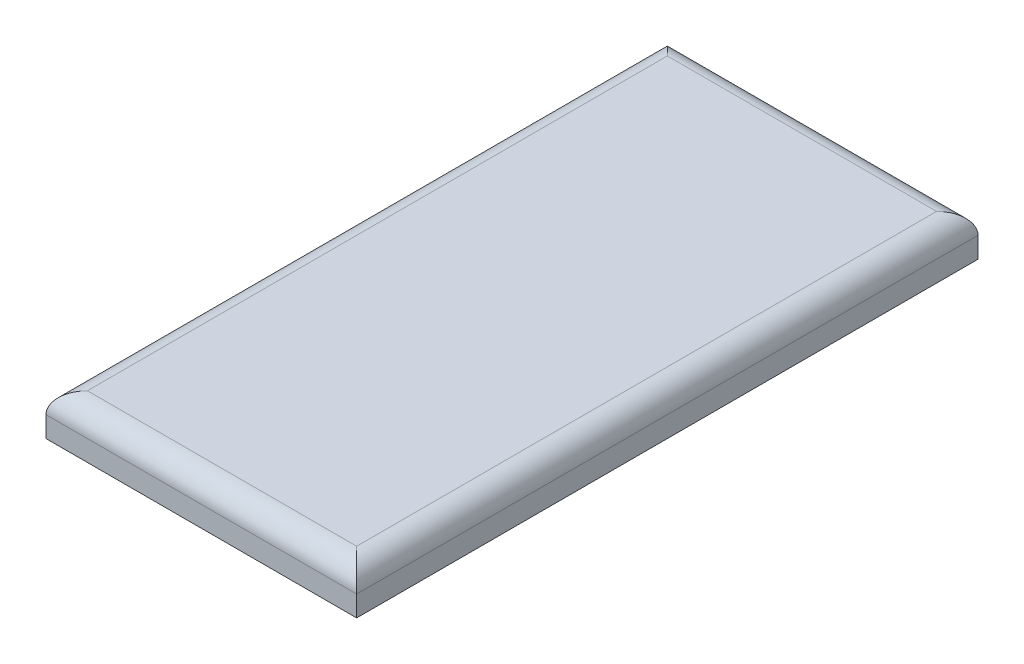
ISO-10303-21;
HEADER;
FILE_DESCRIPTION(('STEP AP214'),'2;1');
FILE_NAME('part.step','',(''),(''),'','','');
FILE_SCHEMA(('AUTOMOTIVE_DESIGN { 1 0 10303 214 1 1 1 1 }'));
ENDSEC;
DATA;
#1=APPLICATION_CONTEXT('core data for automotive mechanical design processes');
#2=APPLICATION_PROTOCOL_DEFINITION('international standard','automotive_design',2000,#1);
#3=PRODUCT_CONTEXT('',#1,'mechanical');
#4=PRODUCT('Part','Part','',(#3));
#5=PRODUCT_RELATED_PRODUCT_CATEGORY('part','',(#4));
#6=PRODUCT_DEFINITION_FORMATION('','',#4);
#7=PRODUCT_DEFINITION_CONTEXT('part definition',#1,'design');
#8=PRODUCT_DEFINITION('design','',#6,#7);
#9=PRODUCT_DEFINITION_SHAPE('','',#8);
#10=(LENGTH_UNIT() NAMED_UNIT(*) SI_UNIT(.MILLI.,.METRE.));
#11=(NAMED_UNIT(*) PLANE_ANGLE_UNIT() SI_UNIT($,.RADIAN.));
#12=(NAMED_UNIT(*) SI_UNIT($,.STERADIAN.) SOLID_ANGLE_UNIT());
#13=UNCERTAINTY_MEASURE_WITH_UNIT(LENGTH_MEASURE(1.E-05),#10,'distance_accuracy_value','');
#14=(GEOMETRIC_REPRESENTATION_CONTEXT(3) GLOBAL_UNCERTAINTY_ASSIGNED_CONTEXT((#13)) GLOBAL_UNIT_ASSIGNED_CONTEXT((#10,
#11,#12)) REPRESENTATION_CONTEXT('',''));
#15=CARTESIAN_POINT('',(0.,0.,0.));
#16=DIRECTION('',(0.,0.,1.));
#17=DIRECTION('',(1.,0.,0.));
#18=AXIS2_PLACEMENT_3D('',#15,#16,#17);
#19=CARTESIAN_POINT('',(75.,20.,150.));
#20=DIRECTION('',(-1.,0.,0.));
#21=DIRECTION('',(0.,0.,1.));
#22=AXIS2_PLACEMENT_3D('',#19,#20,#21);
#23=PLANE('',#22);
#24=DIRECTION('',(0.,-1.,0.));
#25=VECTOR('',#24,1.);
#26=CARTESIAN_POINT('',(75.,20.,-150.));
#27=LINE('',#26,#25);
#28=CARTESIAN_POINT('',(75.,10.,-150.));
#29=VERTEX_POINT('',#28);
#30=CARTESIAN_POINT('',(75.,0.,-150.));
#31=VERTEX_POINT('',#30);
#32=EDGE_CURVE('E86',#29,#31,#27,.T.);
#33=ORIENTED_EDGE('',*,*,#32,.F.);
#34=DIRECTION('',(0.,0.,-1.));
#35=VECTOR('',#34,1.);
#36=CARTESIAN_POINT('',(75.,10.,150.));
#37=LINE('',#36,#35);
#38=CARTESIAN_POINT('',(75.,10.,150.));
#39=VERTEX_POINT('',#38);
#40=EDGE_CURVE('E11',#29,#39,#37,.F.);
#41=ORIENTED_EDGE('',*,*,#40,.T.);
#42=DIRECTION('',(0.,-1.,0.));
#43=VECTOR('',#42,1.);
#44=CARTESIAN_POINT('',(75.,20.,150.));
#45=LINE('',#44,#43);
#46=CARTESIAN_POINT('',(75.,0.,150.));
#47=VERTEX_POINT('',#46);
#48=EDGE_CURVE('E106',#39,#47,#45,.T.);
#49=ORIENTED_EDGE('',*,*,#48,.T.);
#50=DIRECTION('',(0.,0.,-1.));
#51=VECTOR('',#50,1.);
#52=CARTESIAN_POINT('',(75.,0.,150.));
#53=LINE('',#52,#51);
#54=EDGE_CURVE('E101',#47,#31,#53,.T.);
#55=ORIENTED_EDGE('',*,*,#54,.T.);
#56=EDGE_LOOP('',(#33,#41,#49,#55));
#57=FACE_BOUND('',#56,.T.);
#58=ADVANCED_FACE('F34',(#57),#23,.F.);
#59=CARTESIAN_POINT('',(-75.,20.,-150.));
#60=DIRECTION('',(0.,0.,1.));
#61=DIRECTION('',(1.,0.,0.));
#62=AXIS2_PLACEMENT_3D('',#59,#60,#61);
#63=PLANE('',#62);
#64=DIRECTION('',(0.,-1.,0.));
#65=VECTOR('',#64,1.);
#66=CARTESIAN_POINT('',(-75.,20.,-150.));
#67=LINE('',#66,#65);
#68=CARTESIAN_POINT('',(-75.,10.,-150.));
#69=VERTEX_POINT('',#68);
#70=CARTESIAN_POINT('',(-75.,0.,-150.));
#71=VERTEX_POINT('',#70);
#72=EDGE_CURVE('E95',#69,#71,#67,.T.);
#73=ORIENTED_EDGE('',*,*,#72,.F.);
#74=DIRECTION('',(-1.,0.,0.));
#75=VECTOR('',#74,1.);
#76=CARTESIAN_POINT('',(-75.,10.,-150.));
#77=LINE('',#76,#75);
#78=EDGE_CURVE('E43',#69,#29,#77,.F.);
#79=ORIENTED_EDGE('',*,*,#78,.T.);
#80=ORIENTED_EDGE('',*,*,#32,.T.);
#81=DIRECTION('',(-1.,0.,0.));
#82=VECTOR('',#81,1.);
#83=CARTESIAN_POINT('',(-75.,0.,-150.));
#84=LINE('',#83,#82);
#85=EDGE_CURVE('E89',#31,#71,#84,.T.);
#86=ORIENTED_EDGE('',*,*,#85,.T.);
#87=EDGE_LOOP('',(#73,#79,#80,#86));
#88=FACE_BOUND('',#87,.T.);
#89=ADVANCED_FACE('F88',(#88),#63,.F.);
#90=CARTESIAN_POINT('',(-75.,20.,150.));
#91=DIRECTION('',(1.,0.,0.));
#92=DIRECTION('',(0.,0.,-1.));
#93=AXIS2_PLACEMENT_3D('',#90,#91,#92);
#94=PLANE('',#93);
#95=DIRECTION('',(0.,-1.,0.));
#96=VECTOR('',#95,1.);
#97=CARTESIAN_POINT('',(-75.,20.,150.));
#98=LINE('',#97,#96);
#99=CARTESIAN_POINT('',(-75.,10.,150.));
#100=VERTEX_POINT('',#99);
#101=CARTESIAN_POINT('',(-75.,0.,150.));
#102=VERTEX_POINT('',#101);
#103=EDGE_CURVE('E116',#100,#102,#98,.T.);
#104=ORIENTED_EDGE('',*,*,#103,.F.);
#105=DIRECTION('',(0.,0.,1.));
#106=VECTOR('',#105,1.);
#107=CARTESIAN_POINT('',(-75.,10.,150.));
#108=LINE('',#107,#106);
#109=EDGE_CURVE('E58',#100,#69,#108,.F.);
#110=ORIENTED_EDGE('',*,*,#109,.T.);
#111=ORIENTED_EDGE('',*,*,#72,.T.);
#112=DIRECTION('',(0.,0.,1.));
#113=VECTOR('',#112,1.);
#114=CARTESIAN_POINT('',(-75.,0.,150.));
#115=LINE('',#114,#113);
#116=EDGE_CURVE('E103',#71,#102,#115,.T.);
#117=ORIENTED_EDGE('',*,*,#116,.T.);
#118=EDGE_LOOP('',(#104,#110,#111,#117));
#119=FACE_BOUND('',#118,.T.);
#120=ADVANCED_FACE('F154',(#119),#94,.F.);
#121=CARTESIAN_POINT('',(-75.,20.,150.));
#122=DIRECTION('',(0.,0.,-1.));
#123=DIRECTION('',(-1.,0.,0.));
#124=AXIS2_PLACEMENT_3D('',#121,#122,#123);
#125=PLANE('',#124);
#126=ORIENTED_EDGE('',*,*,#48,.F.);
#127=DIRECTION('',(1.,0.,0.));
#128=VECTOR('',#127,1.);
#129=CARTESIAN_POINT('',(-75.,10.,150.));
#130=LINE('',#129,#128);
#131=EDGE_CURVE('E127',#39,#100,#130,.F.);
#132=ORIENTED_EDGE('',*,*,#131,.T.);
#133=ORIENTED_EDGE('',*,*,#103,.T.);
#134=DIRECTION('',(1.,0.,0.));
#135=VECTOR('',#134,1.);
#136=CARTESIAN_POINT('',(-75.,0.,150.));
#137=LINE('',#136,#135);
#138=EDGE_CURVE('E113',#102,#47,#137,.T.);
#139=ORIENTED_EDGE('',*,*,#138,.T.);
#140=EDGE_LOOP('',(#126,#132,#133,#139));
#141=FACE_BOUND('',#140,.T.);
#142=ADVANCED_FACE('F153',(#141),#125,.F.);
#143=CARTESIAN_POINT('',(0.,20.,0.));
#144=DIRECTION('',(0.,-1.,0.));
#145=DIRECTION('',(0.,0.,-1.));
#146=AXIS2_PLACEMENT_3D('',#143,#144,#145);
#147=PLANE('',#146);
#148=DIRECTION('',(0.,0.,1.));
#149=VECTOR('',#148,1.);
#150=CARTESIAN_POINT('',(-65.,20.,0.));
#151=LINE('',#150,#149);
#152=CARTESIAN_POINT('',(-65.,20.,-140.));
#153=VERTEX_POINT('',#152);
#154=CARTESIAN_POINT('',(-65.,20.,140.));
#155=VERTEX_POINT('',#154);
#156=EDGE_CURVE('E122',#153,#155,#151,.T.);
#157=ORIENTED_EDGE('',*,*,#156,.T.);
#158=DIRECTION('',(1.,0.,0.));
#159=VECTOR('',#158,1.);
#160=CARTESIAN_POINT('',(0.,20.,140.));
#161=LINE('',#160,#159);
#162=CARTESIAN_POINT('',(65.,20.,140.));
#163=VERTEX_POINT('',#162);
#164=EDGE_CURVE('E124',#155,#163,#161,.T.);
#165=ORIENTED_EDGE('',*,*,#164,.T.);
#166=DIRECTION('',(0.,0.,-1.));
#167=VECTOR('',#166,1.);
#168=CARTESIAN_POINT('',(65.,20.,0.));
#169=LINE('',#168,#167);
#170=CARTESIAN_POINT('',(65.,20.,-140.));
#171=VERTEX_POINT('',#170);
#172=EDGE_CURVE('E94',#163,#171,#169,.T.);
#173=ORIENTED_EDGE('',*,*,#172,.T.);
#174=DIRECTION('',(-1.,0.,0.));
#175=VECTOR('',#174,1.);
#176=CARTESIAN_POINT('',(0.,20.,-140.));
#177=LINE('',#176,#175);
#178=EDGE_CURVE('E120',#171,#153,#177,.T.);
#179=ORIENTED_EDGE('',*,*,#178,.T.);
#180=EDGE_LOOP('',(#157,#165,#173,#179));
#181=FACE_BOUND('',#180,.T.);
#182=ADVANCED_FACE('F146',(#181),#147,.F.);
#183=CARTESIAN_POINT('',(0.,0.,0.));
#184=DIRECTION('',(0.,-1.,0.));
#185=DIRECTION('',(0.,0.,-1.));
#186=AXIS2_PLACEMENT_3D('',#183,#184,#185);
#187=PLANE('',#186);
#188=ORIENTED_EDGE('',*,*,#54,.F.);
#189=ORIENTED_EDGE('',*,*,#138,.F.);
#190=ORIENTED_EDGE('',*,*,#116,.F.);
#191=ORIENTED_EDGE('',*,*,#85,.F.);
#192=EDGE_LOOP('',(#188,#189,#190,#191));
#193=FACE_BOUND('',#192,.T.);
#194=ADVANCED_FACE('F99',(#193),#187,.T.);
#195=CARTESIAN_POINT('',(0.,10.,-140.));
#196=DIRECTION('',(-1.,0.,0.));
#197=DIRECTION('',(0.,0.,1.));
#198=AXIS2_PLACEMENT_3D('',#195,#196,#197);
#199=CYLINDRICAL_SURFACE('',#198,10.);
#200=CARTESIAN_POINT('',(65.,10.,-140.));
#201=DIRECTION('',(-0.707106781186547,0.,-0.707106781186547));
#202=DIRECTION('',(0.707106781186547,0.,-0.707106781186547));
#203=AXIS2_PLACEMENT_3D('',#200,#201,#202);
#204=ELLIPSE('',#203,14.1421356237309,10.);
#205=EDGE_CURVE('E110',#29,#171,#204,.F.);
#206=ORIENTED_EDGE('',*,*,#205,.F.);
#207=ORIENTED_EDGE('',*,*,#78,.F.);
#208=CARTESIAN_POINT('',(-65.,10.,-140.));
#209=DIRECTION('',(-0.707106781186547,0.,0.707106781186547));
#210=DIRECTION('',(-0.707106781186547,0.,-0.707106781186547));
#211=AXIS2_PLACEMENT_3D('',#208,#209,#210);
#212=ELLIPSE('',#211,14.1421356237309,10.);
#213=EDGE_CURVE('E38',#153,#69,#212,.T.);
#214=ORIENTED_EDGE('',*,*,#213,.F.);
#215=ORIENTED_EDGE('',*,*,#178,.F.);
#216=EDGE_LOOP('',(#206,#207,#214,#215));
#217=FACE_BOUND('',#216,.T.);
#218=ADVANCED_FACE('F36',(#217),#199,.T.);
#219=CARTESIAN_POINT('',(-65.,10.,0.));
#220=DIRECTION('',(0.,0.,1.));
#221=DIRECTION('',(1.,0.,0.));
#222=AXIS2_PLACEMENT_3D('',#219,#220,#221);
#223=CYLINDRICAL_SURFACE('',#222,10.);
#224=ORIENTED_EDGE('',*,*,#213,.T.);
#225=ORIENTED_EDGE('',*,*,#109,.F.);
#226=CARTESIAN_POINT('',(-65.,10.,140.));
#227=DIRECTION('',(0.707106781186547,0.,0.707106781186547));
#228=DIRECTION('',(-0.707106781186547,0.,0.707106781186547));
#229=AXIS2_PLACEMENT_3D('',#226,#227,#228);
#230=ELLIPSE('',#229,14.1421356237309,10.);
#231=EDGE_CURVE('E134',#155,#100,#230,.T.);
#232=ORIENTED_EDGE('',*,*,#231,.F.);
#233=ORIENTED_EDGE('',*,*,#156,.F.);
#234=EDGE_LOOP('',(#224,#225,#232,#233));
#235=FACE_BOUND('',#234,.T.);
#236=ADVANCED_FACE('F171',(#235),#223,.T.);
#237=CARTESIAN_POINT('',(65.,10.,0.));
#238=DIRECTION('',(0.,0.,-1.));
#239=DIRECTION('',(-1.,0.,0.));
#240=AXIS2_PLACEMENT_3D('',#237,#238,#239);
#241=CYLINDRICAL_SURFACE('',#240,10.);
#242=ORIENTED_EDGE('',*,*,#205,.T.);
#243=ORIENTED_EDGE('',*,*,#172,.F.);
#244=CARTESIAN_POINT('',(65.,10.,140.));
#245=DIRECTION('',(0.707106781186547,0.,-0.707106781186547));
#246=DIRECTION('',(-0.707106781186547,0.,-0.707106781186547));
#247=AXIS2_PLACEMENT_3D('',#244,#245,#246);
#248=ELLIPSE('',#247,14.1421356237309,10.);
#249=EDGE_CURVE('E132',#39,#163,#248,.F.);
#250=ORIENTED_EDGE('',*,*,#249,.F.);
#251=ORIENTED_EDGE('',*,*,#40,.F.);
#252=EDGE_LOOP('',(#242,#243,#250,#251));
#253=FACE_BOUND('',#252,.T.);
#254=ADVANCED_FACE('F139',(#253),#241,.T.);
#255=CARTESIAN_POINT('',(0.,10.,140.));
#256=DIRECTION('',(1.,0.,0.));
#257=DIRECTION('',(0.,0.,-1.));
#258=AXIS2_PLACEMENT_3D('',#255,#256,#257);
#259=CYLINDRICAL_SURFACE('',#258,10.);
#260=ORIENTED_EDGE('',*,*,#231,.T.);
#261=ORIENTED_EDGE('',*,*,#131,.F.);
#262=ORIENTED_EDGE('',*,*,#249,.T.);
#263=ORIENTED_EDGE('',*,*,#164,.F.);
#264=EDGE_LOOP('',(#260,#261,#262,#263));
#265=FACE_BOUND('',#264,.T.);
#266=ADVANCED_FACE('F150',(#265),#259,.T.);
#267=CLOSED_SHELL('',(#58,#89,#120,#142,#182,#194,#218,#236,#254,#266));
#268=MANIFOLD_SOLID_BREP('B2',#267);
#269=ADVANCED_BREP_SHAPE_REPRESENTATION('',(#18,#268),#14);
#270=SHAPE_DEFINITION_REPRESENTATION(#9,#269);
ENDSEC;
END-ISO-10303-21;
